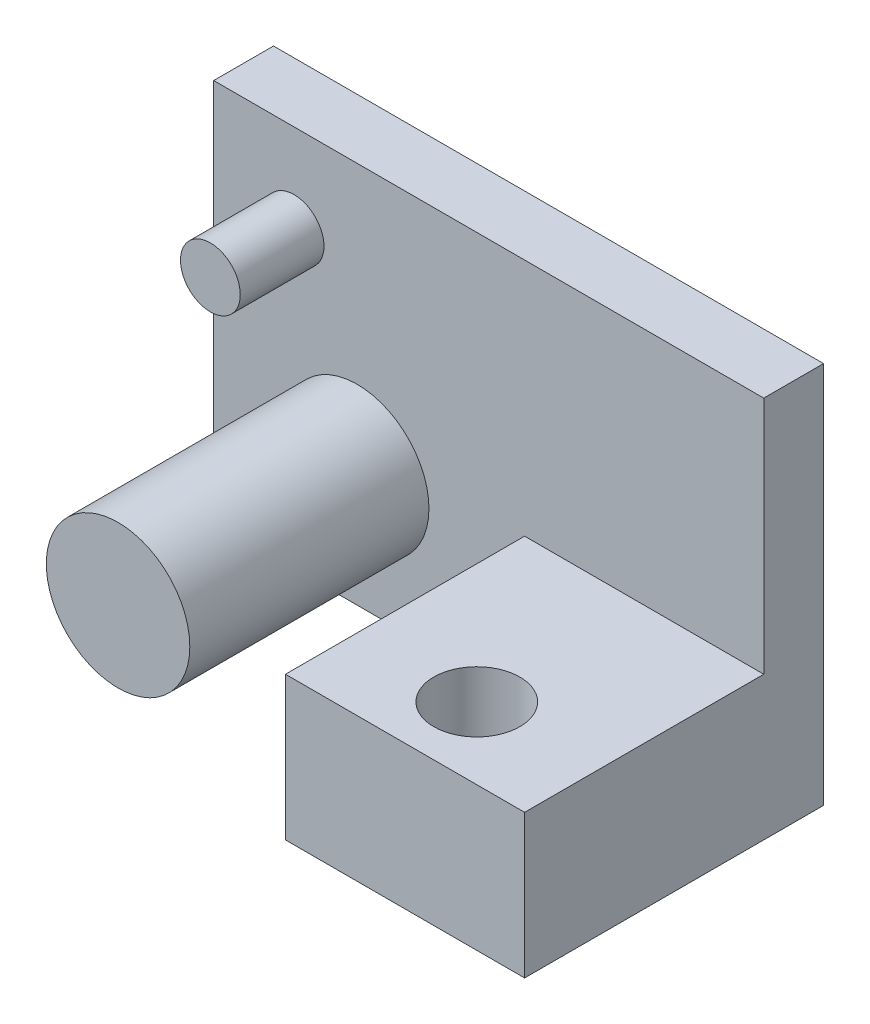
ISO-10303-21;
HEADER;
FILE_DESCRIPTION(('STEP AP214'),'2;1');
FILE_NAME('part.step','',(''),(''),'','','');
FILE_SCHEMA(('AUTOMOTIVE_DESIGN { 1 0 10303 214 1 1 1 1 }'));
ENDSEC;
DATA;
#1=APPLICATION_CONTEXT('core data for automotive mechanical design processes');
#2=APPLICATION_PROTOCOL_DEFINITION('international standard','automotive_design',2000,#1);
#3=PRODUCT_CONTEXT('',#1,'mechanical');
#4=PRODUCT('Part','Part','',(#3));
#5=PRODUCT_RELATED_PRODUCT_CATEGORY('part','',(#4));
#6=PRODUCT_DEFINITION_FORMATION('','',#4);
#7=PRODUCT_DEFINITION_CONTEXT('part definition',#1,'design');
#8=PRODUCT_DEFINITION('design','',#6,#7);
#9=PRODUCT_DEFINITION_SHAPE('','',#8);
#10=(LENGTH_UNIT() NAMED_UNIT(*) SI_UNIT(.MILLI.,.METRE.));
#11=(NAMED_UNIT(*) PLANE_ANGLE_UNIT() SI_UNIT($,.RADIAN.));
#12=(NAMED_UNIT(*) SI_UNIT($,.STERADIAN.) SOLID_ANGLE_UNIT());
#13=UNCERTAINTY_MEASURE_WITH_UNIT(LENGTH_MEASURE(1.E-05),#10,'distance_accuracy_value','');
#14=(GEOMETRIC_REPRESENTATION_CONTEXT(3) GLOBAL_UNCERTAINTY_ASSIGNED_CONTEXT((#13)) GLOBAL_UNIT_ASSIGNED_CONTEXT((#10,
#11,#12)) REPRESENTATION_CONTEXT('',''));
#15=CARTESIAN_POINT('',(0.,0.,0.));
#16=DIRECTION('',(0.,0.,1.));
#17=DIRECTION('',(1.,0.,0.));
#18=AXIS2_PLACEMENT_3D('',#15,#16,#17);
#19=CARTESIAN_POINT('',(0.,0.,2.5));
#20=DIRECTION('',(0.,0.,1.));
#21=DIRECTION('',(1.,0.,0.));
#22=AXIS2_PLACEMENT_3D('',#19,#20,#21);
#23=PLANE('',#22);
#24=DIRECTION('',(-1.,0.,0.));
#25=VECTOR('',#24,1.);
#26=CARTESIAN_POINT('',(-37.6903078202995,-25.2897254575707,2.5));
#27=LINE('',#26,#25);
#28=CARTESIAN_POINT('',(-35.6903078202995,-25.2897254575707,2.5));
#29=VERTEX_POINT('',#28);
#30=CARTESIAN_POINT('',(-37.6903078202995,-25.2897254575707,2.5));
#31=VERTEX_POINT('',#30);
#32=EDGE_CURVE('E47',#29,#31,#27,.T.);
#33=ORIENTED_EDGE('',*,*,#32,.F.);
#34=DIRECTION('',(0.,1.,0.));
#35=VECTOR('',#34,1.);
#36=CARTESIAN_POINT('',(-35.6903078202995,-28.2897254575707,2.5));
#37=LINE('',#36,#35);
#38=CARTESIAN_POINT('',(-35.6903078202995,-28.2897254575707,2.5));
#39=VERTEX_POINT('',#38);
#40=EDGE_CURVE('E108',#39,#29,#37,.T.);
#41=ORIENTED_EDGE('',*,*,#40,.F.);
#42=DIRECTION('',(1.,0.,0.));
#43=VECTOR('',#42,1.);
#44=CARTESIAN_POINT('',(-35.6903078202995,-28.2897254575707,2.5));
#45=LINE('',#44,#43);
#46=CARTESIAN_POINT('',(-24.6903078202995,-28.2897254575707,2.5));
#47=VERTEX_POINT('',#46);
#48=EDGE_CURVE('E116',#39,#47,#45,.T.);
#49=ORIENTED_EDGE('',*,*,#48,.T.);
#50=DIRECTION('',(0.,-1.,0.));
#51=VECTOR('',#50,1.);
#52=CARTESIAN_POINT('',(-24.6903078202995,-28.2897254575707,2.5));
#53=LINE('',#52,#51);
#54=CARTESIAN_POINT('',(-24.6903078202995,-22.2897254575707,2.5));
#55=VERTEX_POINT('',#54);
#56=EDGE_CURVE('E164',#55,#47,#53,.T.);
#57=ORIENTED_EDGE('',*,*,#56,.F.);
#58=DIRECTION('',(-1.,0.,0.));
#59=VECTOR('',#58,1.);
#60=CARTESIAN_POINT('',(-24.6903078202995,-22.2897254575707,2.5));
#61=LINE('',#60,#59);
#62=CARTESIAN_POINT('',(-14.6903078202995,-22.2897254575707,2.5));
#63=VERTEX_POINT('',#62);
#64=EDGE_CURVE('E169',#63,#55,#61,.T.);
#65=ORIENTED_EDGE('',*,*,#64,.F.);
#66=DIRECTION('',(0.,-1.,0.));
#67=VECTOR('',#66,1.);
#68=CARTESIAN_POINT('',(-14.6903078202995,0.,2.5));
#69=LINE('',#68,#67);
#70=CARTESIAN_POINT('',(-14.6903078202995,-12.2897254575707,2.5));
#71=VERTEX_POINT('',#70);
#72=EDGE_CURVE('E150',#71,#63,#69,.T.);
#73=ORIENTED_EDGE('',*,*,#72,.F.);
#74=DIRECTION('',(-1.,0.,0.));
#75=VECTOR('',#74,1.);
#76=CARTESIAN_POINT('',(-39.6903078202996,-12.2897254575707,2.5));
#77=LINE('',#76,#75);
#78=CARTESIAN_POINT('',(-37.6903078202995,-12.2897254575707,2.5));
#79=VERTEX_POINT('',#78);
#80=EDGE_CURVE('E140',#71,#79,#77,.T.);
#81=ORIENTED_EDGE('',*,*,#80,.T.);
#82=DIRECTION('',(0.,1.,0.));
#83=VECTOR('',#82,1.);
#84=CARTESIAN_POINT('',(-37.6903078202995,-28.2897254575707,2.5));
#85=LINE('',#84,#83);
#86=EDGE_CURVE('E54',#31,#79,#85,.T.);
#87=ORIENTED_EDGE('',*,*,#86,.F.);
#88=EDGE_LOOP('',(#33,#41,#49,#57,#65,#73,#81,#87));
#89=FACE_BOUND('',#88,.T.);
#90=CARTESIAN_POINT('',(-31.6903078202995,-23.2897254575707,2.5));
#91=DIRECTION('',(0.,0.,1.));
#92=DIRECTION('',(1.,0.,0.));
#93=AXIS2_PLACEMENT_3D('',#90,#91,#92);
#94=CIRCLE('',#93,3.);
#95=CARTESIAN_POINT('',(-28.6903078202995,-23.2897254575707,2.5));
#96=VERTEX_POINT('',#95);
#97=EDGE_CURVE('E131',#96,#96,#94,.T.);
#98=ORIENTED_EDGE('',*,*,#97,.F.);
#99=EDGE_LOOP('',(#98));
#100=FACE_BOUND('',#99,.T.);
#101=CARTESIAN_POINT('',(-34.3303078202995,-15.9897254575707,2.5));
#102=DIRECTION('',(0.,0.,1.));
#103=DIRECTION('',(1.,0.,0.));
#104=AXIS2_PLACEMENT_3D('',#101,#102,#103);
#105=CIRCLE('',#104,1.25);
#106=CARTESIAN_POINT('',(-33.0803078202995,-15.9897254575707,2.5));
#107=VERTEX_POINT('',#106);
#108=EDGE_CURVE('E146',#107,#107,#105,.T.);
#109=ORIENTED_EDGE('',*,*,#108,.F.);
#110=EDGE_LOOP('',(#109));
#111=FACE_BOUND('',#110,.T.);
#112=ADVANCED_FACE('F32',(#89,#100,#111),#23,.T.);
#113=CARTESIAN_POINT('',(-35.6903078202995,-28.2897254575707,2.5));
#114=DIRECTION('',(0.,1.,0.));
#115=DIRECTION('',(0.,0.,1.));
#116=AXIS2_PLACEMENT_3D('',#113,#114,#115);
#117=PLANE('',#116);
#118=CARTESIAN_POINT('',(-19.6903078202995,-28.2897254575707,9.5));
#119=DIRECTION('',(0.,1.,0.));
#120=DIRECTION('',(0.,0.,1.));
#121=AXIS2_PLACEMENT_3D('',#118,#119,#120);
#122=CIRCLE('',#121,1.8);
#123=CARTESIAN_POINT('',(-19.6903078202995,-28.2897254575707,11.3));
#124=VERTEX_POINT('',#123);
#125=EDGE_CURVE('E161',#124,#124,#122,.T.);
#126=ORIENTED_EDGE('',*,*,#125,.T.);
#127=EDGE_LOOP('',(#126));
#128=FACE_BOUND('',#127,.T.);
#129=ORIENTED_EDGE('',*,*,#48,.F.);
#130=DIRECTION('',(0.,0.,1.));
#131=VECTOR('',#130,1.);
#132=CARTESIAN_POINT('',(-35.6903078202995,-28.2897254575707,-7.5));
#133=LINE('',#132,#131);
#134=CARTESIAN_POINT('',(-35.6903078202995,-28.2897254575707,0.));
#135=VERTEX_POINT('',#134);
#136=EDGE_CURVE('E104',#135,#39,#133,.T.);
#137=ORIENTED_EDGE('',*,*,#136,.F.);
#138=DIRECTION('',(1.,0.,0.));
#139=VECTOR('',#138,1.);
#140=CARTESIAN_POINT('',(-35.6903078202995,-28.2897254575707,0.));
#141=LINE('',#140,#139);
#142=CARTESIAN_POINT('',(-14.6903078202995,-28.2897254575707,0.));
#143=VERTEX_POINT('',#142);
#144=EDGE_CURVE('E123',#135,#143,#141,.T.);
#145=ORIENTED_EDGE('',*,*,#144,.T.);
#146=DIRECTION('',(0.,0.,-1.));
#147=VECTOR('',#146,1.);
#148=CARTESIAN_POINT('',(-14.6903078202995,-28.2897254575707,12.5));
#149=LINE('',#148,#147);
#150=CARTESIAN_POINT('',(-14.6903078202995,-28.2897254575707,12.5));
#151=VERTEX_POINT('',#150);
#152=EDGE_CURVE('E184',#151,#143,#149,.T.);
#153=ORIENTED_EDGE('',*,*,#152,.F.);
#154=DIRECTION('',(1.,0.,0.));
#155=VECTOR('',#154,1.);
#156=CARTESIAN_POINT('',(-24.6903078202995,-28.2897254575707,12.5));
#157=LINE('',#156,#155);
#158=CARTESIAN_POINT('',(-24.6903078202995,-28.2897254575707,12.5));
#159=VERTEX_POINT('',#158);
#160=EDGE_CURVE('E168',#159,#151,#157,.T.);
#161=ORIENTED_EDGE('',*,*,#160,.F.);
#162=DIRECTION('',(0.,0.,-1.));
#163=VECTOR('',#162,1.);
#164=CARTESIAN_POINT('',(-24.6903078202995,-28.2897254575707,12.5));
#165=LINE('',#164,#163);
#166=EDGE_CURVE('E120',#159,#47,#165,.T.);
#167=ORIENTED_EDGE('',*,*,#166,.T.);
#168=EDGE_LOOP('',(#129,#137,#145,#153,#161,#167));
#169=FACE_BOUND('',#168,.T.);
#170=ADVANCED_FACE('F34',(#128,#169),#117,.F.);
#171=CARTESIAN_POINT('',(0.,0.,0.));
#172=DIRECTION('',(0.,0.,1.));
#173=DIRECTION('',(1.,0.,0.));
#174=AXIS2_PLACEMENT_3D('',#171,#172,#173);
#175=PLANE('',#174);
#176=DIRECTION('',(0.,1.,0.));
#177=VECTOR('',#176,1.);
#178=CARTESIAN_POINT('',(-35.6903078202995,0.,0.));
#179=LINE('',#178,#177);
#180=CARTESIAN_POINT('',(-35.6903078202995,-25.2897254575707,0.));
#181=VERTEX_POINT('',#180);
#182=EDGE_CURVE('E11',#135,#181,#179,.T.);
#183=ORIENTED_EDGE('',*,*,#182,.T.);
#184=DIRECTION('',(-1.,0.,0.));
#185=VECTOR('',#184,1.);
#186=CARTESIAN_POINT('',(0.,-25.2897254575707,0.));
#187=LINE('',#186,#185);
#188=CARTESIAN_POINT('',(-37.6903078202995,-25.2897254575707,0.));
#189=VERTEX_POINT('',#188);
#190=EDGE_CURVE('E200',#181,#189,#187,.T.);
#191=ORIENTED_EDGE('',*,*,#190,.T.);
#192=DIRECTION('',(0.,1.,0.));
#193=VECTOR('',#192,1.);
#194=CARTESIAN_POINT('',(-37.6903078202995,0.,0.));
#195=LINE('',#194,#193);
#196=CARTESIAN_POINT('',(-37.6903078202995,-12.2897254575707,0.));
#197=VERTEX_POINT('',#196);
#198=EDGE_CURVE('E136',#189,#197,#195,.T.);
#199=ORIENTED_EDGE('',*,*,#198,.T.);
#200=DIRECTION('',(-1.,0.,0.));
#201=VECTOR('',#200,1.);
#202=CARTESIAN_POINT('',(-39.6903078202996,-12.2897254575707,0.));
#203=LINE('',#202,#201);
#204=CARTESIAN_POINT('',(-14.6903078202995,-12.2897254575707,0.));
#205=VERTEX_POINT('',#204);
#206=EDGE_CURVE('E154',#205,#197,#203,.T.);
#207=ORIENTED_EDGE('',*,*,#206,.F.);
#208=DIRECTION('',(0.,-1.,0.));
#209=VECTOR('',#208,1.);
#210=CARTESIAN_POINT('',(-14.6903078202995,0.,0.));
#211=LINE('',#210,#209);
#212=EDGE_CURVE('E143',#205,#143,#211,.T.);
#213=ORIENTED_EDGE('',*,*,#212,.T.);
#214=ORIENTED_EDGE('',*,*,#144,.F.);
#215=EDGE_LOOP('',(#183,#191,#199,#207,#213,#214));
#216=FACE_BOUND('',#215,.T.);
#217=ADVANCED_FACE('F206',(#216),#175,.F.);
#218=CARTESIAN_POINT('',(-31.6903078202995,-23.2897254575707,12.5));
#219=DIRECTION('',(0.,0.,-1.));
#220=DIRECTION('',(-1.,0.,0.));
#221=AXIS2_PLACEMENT_3D('',#218,#219,#220);
#222=CYLINDRICAL_SURFACE('',#221,3.);
#223=CARTESIAN_POINT('',(-31.6903078202995,-23.2897254575707,12.5));
#224=DIRECTION('',(0.,0.,1.));
#225=DIRECTION('',(1.,0.,0.));
#226=AXIS2_PLACEMENT_3D('',#223,#224,#225);
#227=CIRCLE('',#226,3.);
#228=CARTESIAN_POINT('',(-28.6903078202995,-23.2897254575707,12.5));
#229=VERTEX_POINT('',#228);
#230=EDGE_CURVE('E128',#229,#229,#227,.T.);
#231=ORIENTED_EDGE('',*,*,#230,.F.);
#232=EDGE_LOOP('',(#231));
#233=FACE_BOUND('',#232,.T.);
#234=ORIENTED_EDGE('',*,*,#97,.T.);
#235=EDGE_LOOP('',(#234));
#236=FACE_BOUND('',#235,.T.);
#237=ADVANCED_FACE('F193',(#233,#236),#222,.T.);
#238=CARTESIAN_POINT('',(-31.6903078202995,-23.2897254575707,12.5));
#239=DIRECTION('',(0.,0.,1.));
#240=DIRECTION('',(1.,0.,0.));
#241=AXIS2_PLACEMENT_3D('',#238,#239,#240);
#242=PLANE('',#241);
#243=ORIENTED_EDGE('',*,*,#230,.T.);
#244=EDGE_LOOP('',(#243));
#245=FACE_BOUND('',#244,.T.);
#246=ADVANCED_FACE('F240',(#245),#242,.T.);
#247=CARTESIAN_POINT('',(-24.6903078202995,-28.2897254575707,12.5));
#248=DIRECTION('',(1.,0.,0.));
#249=DIRECTION('',(0.,0.,-1.));
#250=AXIS2_PLACEMENT_3D('',#247,#248,#249);
#251=PLANE('',#250);
#252=ORIENTED_EDGE('',*,*,#56,.T.);
#253=ORIENTED_EDGE('',*,*,#166,.F.);
#254=DIRECTION('',(0.,-1.,0.));
#255=VECTOR('',#254,1.);
#256=CARTESIAN_POINT('',(-24.6903078202995,-28.2897254575707,12.5));
#257=LINE('',#256,#255);
#258=CARTESIAN_POINT('',(-24.6903078202995,-22.2897254575707,12.5));
#259=VERTEX_POINT('',#258);
#260=EDGE_CURVE('E165',#259,#159,#257,.T.);
#261=ORIENTED_EDGE('',*,*,#260,.F.);
#262=DIRECTION('',(0.,0.,-1.));
#263=VECTOR('',#262,1.);
#264=CARTESIAN_POINT('',(-24.6903078202995,-22.2897254575707,12.5));
#265=LINE('',#264,#263);
#266=EDGE_CURVE('E175',#259,#55,#265,.T.);
#267=ORIENTED_EDGE('',*,*,#266,.T.);
#268=EDGE_LOOP('',(#252,#253,#261,#267));
#269=FACE_BOUND('',#268,.T.);
#270=ADVANCED_FACE('F219',(#269),#251,.F.);
#271=CARTESIAN_POINT('',(-14.6903078202995,-28.2897254575707,12.5));
#272=DIRECTION('',(-1.,0.,0.));
#273=DIRECTION('',(0.,0.,1.));
#274=AXIS2_PLACEMENT_3D('',#271,#272,#273);
#275=PLANE('',#274);
#276=ORIENTED_EDGE('',*,*,#212,.F.);
#277=DIRECTION('',(0.,0.,1.));
#278=VECTOR('',#277,1.);
#279=CARTESIAN_POINT('',(-14.6903078202995,-12.2897254575707,12.5));
#280=LINE('',#279,#278);
#281=EDGE_CURVE('E122',#205,#71,#280,.T.);
#282=ORIENTED_EDGE('',*,*,#281,.T.);
#283=ORIENTED_EDGE('',*,*,#72,.T.);
#284=DIRECTION('',(0.,0.,-1.));
#285=VECTOR('',#284,1.);
#286=CARTESIAN_POINT('',(-14.6903078202995,-22.2897254575707,12.5));
#287=LINE('',#286,#285);
#288=CARTESIAN_POINT('',(-14.6903078202995,-22.2897254575707,12.5));
#289=VERTEX_POINT('',#288);
#290=EDGE_CURVE('E181',#289,#63,#287,.T.);
#291=ORIENTED_EDGE('',*,*,#290,.F.);
#292=DIRECTION('',(0.,1.,0.));
#293=VECTOR('',#292,1.);
#294=CARTESIAN_POINT('',(-14.6903078202995,-28.2897254575707,12.5));
#295=LINE('',#294,#293);
#296=EDGE_CURVE('E171',#151,#289,#295,.T.);
#297=ORIENTED_EDGE('',*,*,#296,.F.);
#298=ORIENTED_EDGE('',*,*,#152,.T.);
#299=EDGE_LOOP('',(#276,#282,#283,#291,#297,#298));
#300=FACE_BOUND('',#299,.T.);
#301=ADVANCED_FACE('F212',(#300),#275,.F.);
#302=CARTESIAN_POINT('',(-24.6903078202995,-22.2897254575707,12.5));
#303=DIRECTION('',(0.,-1.,0.));
#304=DIRECTION('',(0.,0.,-1.));
#305=AXIS2_PLACEMENT_3D('',#302,#303,#304);
#306=PLANE('',#305);
#307=CARTESIAN_POINT('',(-19.6903078202995,-22.2897254575707,9.5));
#308=DIRECTION('',(0.,1.,0.));
#309=DIRECTION('',(0.,0.,1.));
#310=AXIS2_PLACEMENT_3D('',#307,#308,#309);
#311=CIRCLE('',#310,1.8);
#312=CARTESIAN_POINT('',(-19.6903078202995,-22.2897254575707,11.3));
#313=VERTEX_POINT('',#312);
#314=EDGE_CURVE('E157',#313,#313,#311,.T.);
#315=ORIENTED_EDGE('',*,*,#314,.F.);
#316=EDGE_LOOP('',(#315));
#317=FACE_BOUND('',#316,.T.);
#318=ORIENTED_EDGE('',*,*,#64,.T.);
#319=ORIENTED_EDGE('',*,*,#266,.F.);
#320=DIRECTION('',(-1.,0.,0.));
#321=VECTOR('',#320,1.);
#322=CARTESIAN_POINT('',(-24.6903078202995,-22.2897254575707,12.5));
#323=LINE('',#322,#321);
#324=EDGE_CURVE('E173',#289,#259,#323,.T.);
#325=ORIENTED_EDGE('',*,*,#324,.F.);
#326=ORIENTED_EDGE('',*,*,#290,.T.);
#327=EDGE_LOOP('',(#318,#319,#325,#326));
#328=FACE_BOUND('',#327,.T.);
#329=ADVANCED_FACE('F222',(#317,#328),#306,.F.);
#330=CARTESIAN_POINT('',(0.,0.,12.5));
#331=DIRECTION('',(0.,0.,-1.));
#332=DIRECTION('',(-1.,0.,0.));
#333=AXIS2_PLACEMENT_3D('',#330,#331,#332);
#334=PLANE('',#333);
#335=ORIENTED_EDGE('',*,*,#260,.T.);
#336=ORIENTED_EDGE('',*,*,#160,.T.);
#337=ORIENTED_EDGE('',*,*,#296,.T.);
#338=ORIENTED_EDGE('',*,*,#324,.T.);
#339=EDGE_LOOP('',(#335,#336,#337,#338));
#340=FACE_BOUND('',#339,.T.);
#341=ADVANCED_FACE('F215',(#340),#334,.F.);
#342=CARTESIAN_POINT('',(-19.6903078202995,-32.2897254575707,9.5));
#343=DIRECTION('',(0.,1.,0.));
#344=DIRECTION('',(0.,0.,1.));
#345=AXIS2_PLACEMENT_3D('',#342,#343,#344);
#346=CYLINDRICAL_SURFACE('',#345,1.8);
#347=ORIENTED_EDGE('',*,*,#314,.T.);
#348=EDGE_LOOP('',(#347));
#349=FACE_BOUND('',#348,.T.);
#350=ORIENTED_EDGE('',*,*,#125,.F.);
#351=EDGE_LOOP('',(#350));
#352=FACE_BOUND('',#351,.T.);
#353=ADVANCED_FACE('F231',(#349,#352),#346,.F.);
#354=CARTESIAN_POINT('',(-39.6903078202996,-12.2897254575707,0.));
#355=DIRECTION('',(0.,1.,0.));
#356=DIRECTION('',(0.,0.,1.));
#357=AXIS2_PLACEMENT_3D('',#354,#355,#356);
#358=PLANE('',#357);
#359=DIRECTION('',(0.,0.,-1.));
#360=VECTOR('',#359,1.);
#361=CARTESIAN_POINT('',(-37.6903078202995,-12.2897254575707,0.));
#362=LINE('',#361,#360);
#363=EDGE_CURVE('E126',#79,#197,#362,.T.);
#364=ORIENTED_EDGE('',*,*,#363,.F.);
#365=ORIENTED_EDGE('',*,*,#80,.F.);
#366=ORIENTED_EDGE('',*,*,#281,.F.);
#367=ORIENTED_EDGE('',*,*,#206,.T.);
#368=EDGE_LOOP('',(#364,#365,#366,#367));
#369=FACE_BOUND('',#368,.T.);
#370=ADVANCED_FACE('F256',(#369),#358,.T.);
#371=CARTESIAN_POINT('',(-37.6903078202995,-28.2897254575707,-7.5));
#372=DIRECTION('',(1.,0.,0.));
#373=DIRECTION('',(0.,0.,-1.));
#374=AXIS2_PLACEMENT_3D('',#371,#372,#373);
#375=PLANE('',#374);
#376=ORIENTED_EDGE('',*,*,#198,.F.);
#377=DIRECTION('',(0.,0.,1.));
#378=VECTOR('',#377,1.);
#379=CARTESIAN_POINT('',(-37.6903078202995,-25.2897254575707,-7.5));
#380=LINE('',#379,#378);
#381=EDGE_CURVE('E40',#189,#31,#380,.T.);
#382=ORIENTED_EDGE('',*,*,#381,.T.);
#383=ORIENTED_EDGE('',*,*,#86,.T.);
#384=ORIENTED_EDGE('',*,*,#363,.T.);
#385=EDGE_LOOP('',(#376,#382,#383,#384));
#386=FACE_BOUND('',#385,.T.);
#387=ADVANCED_FACE('F135',(#386),#375,.F.);
#388=CARTESIAN_POINT('',(-34.3303078202995,-15.9897254575707,6.));
#389=DIRECTION('',(0.,0.,-1.));
#390=DIRECTION('',(-1.,0.,0.));
#391=AXIS2_PLACEMENT_3D('',#388,#389,#390);
#392=CYLINDRICAL_SURFACE('',#391,1.25);
#393=CARTESIAN_POINT('',(-34.3303078202995,-15.9897254575707,6.));
#394=DIRECTION('',(0.,0.,1.));
#395=DIRECTION('',(1.,0.,0.));
#396=AXIS2_PLACEMENT_3D('',#393,#394,#395);
#397=CIRCLE('',#396,1.25);
#398=CARTESIAN_POINT('',(-33.0803078202995,-15.9897254575707,6.));
#399=VERTEX_POINT('',#398);
#400=EDGE_CURVE('E141',#399,#399,#397,.T.);
#401=ORIENTED_EDGE('',*,*,#400,.F.);
#402=EDGE_LOOP('',(#401));
#403=FACE_BOUND('',#402,.T.);
#404=ORIENTED_EDGE('',*,*,#108,.T.);
#405=EDGE_LOOP('',(#404));
#406=FACE_BOUND('',#405,.T.);
#407=ADVANCED_FACE('F265',(#403,#406),#392,.T.);
#408=CARTESIAN_POINT('',(-34.3303078202995,-15.9897254575707,6.));
#409=DIRECTION('',(0.,0.,1.));
#410=DIRECTION('',(1.,0.,0.));
#411=AXIS2_PLACEMENT_3D('',#408,#409,#410);
#412=PLANE('',#411);
#413=ORIENTED_EDGE('',*,*,#400,.T.);
#414=EDGE_LOOP('',(#413));
#415=FACE_BOUND('',#414,.T.);
#416=ADVANCED_FACE('F268',(#415),#412,.T.);
#417=CARTESIAN_POINT('',(-35.6903078202995,-28.2897254575707,-7.5));
#418=DIRECTION('',(1.,0.,0.));
#419=DIRECTION('',(0.,0.,-1.));
#420=AXIS2_PLACEMENT_3D('',#417,#418,#419);
#421=PLANE('',#420);
#422=ORIENTED_EDGE('',*,*,#136,.T.);
#423=ORIENTED_EDGE('',*,*,#40,.T.);
#424=DIRECTION('',(0.,0.,1.));
#425=VECTOR('',#424,1.);
#426=CARTESIAN_POINT('',(-35.6903078202995,-25.2897254575707,-7.5));
#427=LINE('',#426,#425);
#428=EDGE_CURVE('E112',#181,#29,#427,.T.);
#429=ORIENTED_EDGE('',*,*,#428,.F.);
#430=ORIENTED_EDGE('',*,*,#182,.F.);
#431=EDGE_LOOP('',(#422,#423,#429,#430));
#432=FACE_BOUND('',#431,.T.);
#433=ADVANCED_FACE('F106',(#432),#421,.F.);
#434=CARTESIAN_POINT('',(-37.6903078202995,-25.2897254575707,-7.5));
#435=DIRECTION('',(0.,1.,0.));
#436=DIRECTION('',(0.,0.,1.));
#437=AXIS2_PLACEMENT_3D('',#434,#435,#436);
#438=PLANE('',#437);
#439=ORIENTED_EDGE('',*,*,#428,.T.);
#440=ORIENTED_EDGE('',*,*,#32,.T.);
#441=ORIENTED_EDGE('',*,*,#381,.F.);
#442=ORIENTED_EDGE('',*,*,#190,.F.);
#443=EDGE_LOOP('',(#439,#440,#441,#442));
#444=FACE_BOUND('',#443,.T.);
#445=ADVANCED_FACE('F205',(#444),#438,.F.);
#446=CLOSED_SHELL('',(#112,#170,#217,#237,#246,#270,#301,#329,#341,#353,#370,#387,#407,#416,
#433,#445));
#447=MANIFOLD_SOLID_BREP('B2',#446);
#448=ADVANCED_BREP_SHAPE_REPRESENTATION('',(#18,#447),#14);
#449=SHAPE_DEFINITION_REPRESENTATION(#9,#448);
ENDSEC;
END-ISO-10303-21;
